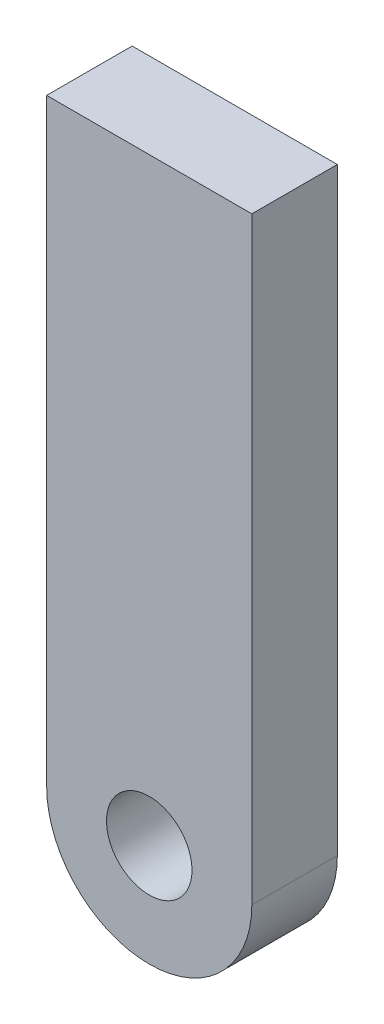
ISO-10303-21;
HEADER;
FILE_DESCRIPTION(('STEP AP214'),'2;1');
FILE_NAME('part.step','',(''),(''),'','','');
FILE_SCHEMA(('AUTOMOTIVE_DESIGN { 1 0 10303 214 1 1 1 1 }'));
ENDSEC;
DATA;
#1=APPLICATION_CONTEXT('core data for automotive mechanical design processes');
#2=APPLICATION_PROTOCOL_DEFINITION('international standard','automotive_design',2000,#1);
#3=PRODUCT_CONTEXT('',#1,'mechanical');
#4=PRODUCT('Part','Part','',(#3));
#5=PRODUCT_RELATED_PRODUCT_CATEGORY('part','',(#4));
#6=PRODUCT_DEFINITION_FORMATION('','',#4);
#7=PRODUCT_DEFINITION_CONTEXT('part definition',#1,'design');
#8=PRODUCT_DEFINITION('design','',#6,#7);
#9=PRODUCT_DEFINITION_SHAPE('','',#8);
#10=(LENGTH_UNIT() NAMED_UNIT(*) SI_UNIT(.MILLI.,.METRE.));
#11=(NAMED_UNIT(*) PLANE_ANGLE_UNIT() SI_UNIT($,.RADIAN.));
#12=(NAMED_UNIT(*) SI_UNIT($,.STERADIAN.) SOLID_ANGLE_UNIT());
#13=UNCERTAINTY_MEASURE_WITH_UNIT(LENGTH_MEASURE(1.E-05),#10,'distance_accuracy_value','');
#14=(GEOMETRIC_REPRESENTATION_CONTEXT(3) GLOBAL_UNCERTAINTY_ASSIGNED_CONTEXT((#13)) GLOBAL_UNIT_ASSIGNED_CONTEXT((#10,
#11,#12)) REPRESENTATION_CONTEXT('',''));
#15=CARTESIAN_POINT('',(0.,0.,0.));
#16=DIRECTION('',(0.,0.,1.));
#17=DIRECTION('',(1.,0.,0.));
#18=AXIS2_PLACEMENT_3D('',#15,#16,#17);
#19=CARTESIAN_POINT('',(0.,0.,6.35));
#20=DIRECTION('',(0.,0.,1.));
#21=DIRECTION('',(1.,0.,0.));
#22=AXIS2_PLACEMENT_3D('',#19,#20,#21);
#23=PLANE('',#22);
#24=CARTESIAN_POINT('',(0.,0.,6.35));
#25=DIRECTION('',(0.,0.,1.));
#26=DIRECTION('',(1.,0.,0.));
#27=AXIS2_PLACEMENT_3D('',#24,#25,#26);
#28=CIRCLE('',#27,7.62);
#29=CARTESIAN_POINT('',(-7.62,0.,6.35));
#30=VERTEX_POINT('',#29);
#31=CARTESIAN_POINT('',(7.62,0.,6.35));
#32=VERTEX_POINT('',#31);
#33=EDGE_CURVE('E85',#30,#32,#28,.T.);
#34=ORIENTED_EDGE('',*,*,#33,.T.);
#35=DIRECTION('',(0.,1.,0.));
#36=VECTOR('',#35,1.);
#37=CARTESIAN_POINT('',(7.62,0.,6.35));
#38=LINE('',#37,#36);
#39=CARTESIAN_POINT('',(7.61999999999999,44.45,6.35));
#40=VERTEX_POINT('',#39);
#41=EDGE_CURVE('E80',#32,#40,#38,.T.);
#42=ORIENTED_EDGE('',*,*,#41,.T.);
#43=DIRECTION('',(-1.,0.,0.));
#44=VECTOR('',#43,1.);
#45=CARTESIAN_POINT('',(-7.62,44.45,6.35));
#46=LINE('',#45,#44);
#47=CARTESIAN_POINT('',(-7.62,44.45,6.35));
#48=VERTEX_POINT('',#47);
#49=EDGE_CURVE('E83',#40,#48,#46,.T.);
#50=ORIENTED_EDGE('',*,*,#49,.T.);
#51=DIRECTION('',(0.,-1.,0.));
#52=VECTOR('',#51,1.);
#53=CARTESIAN_POINT('',(-7.62,0.,6.35));
#54=LINE('',#53,#52);
#55=EDGE_CURVE('E50',#48,#30,#54,.T.);
#56=ORIENTED_EDGE('',*,*,#55,.T.);
#57=EDGE_LOOP('',(#34,#42,#50,#56));
#58=FACE_BOUND('',#57,.T.);
#59=CARTESIAN_POINT('',(0.,0.,6.35));
#60=DIRECTION('',(0.,0.,1.));
#61=DIRECTION('',(1.,0.,0.));
#62=AXIS2_PLACEMENT_3D('',#59,#60,#61);
#63=CIRCLE('',#62,3.175);
#64=CARTESIAN_POINT('',(3.175,0.,6.35));
#65=VERTEX_POINT('',#64);
#66=EDGE_CURVE('E100',#65,#65,#63,.T.);
#67=ORIENTED_EDGE('',*,*,#66,.F.);
#68=EDGE_LOOP('',(#67));
#69=FACE_BOUND('',#68,.T.);
#70=ADVANCED_FACE('F33',(#58,#69),#23,.T.);
#71=CARTESIAN_POINT('',(0.,0.,0.));
#72=DIRECTION('',(0.,0.,1.));
#73=DIRECTION('',(1.,0.,0.));
#74=AXIS2_PLACEMENT_3D('',#71,#72,#73);
#75=PLANE('',#74);
#76=CARTESIAN_POINT('',(0.,0.,0.));
#77=DIRECTION('',(0.,0.,1.));
#78=DIRECTION('',(1.,0.,0.));
#79=AXIS2_PLACEMENT_3D('',#76,#77,#78);
#80=CIRCLE('',#79,7.62);
#81=CARTESIAN_POINT('',(-7.62,0.,0.));
#82=VERTEX_POINT('',#81);
#83=CARTESIAN_POINT('',(7.62,0.,0.));
#84=VERTEX_POINT('',#83);
#85=EDGE_CURVE('E97',#82,#84,#80,.T.);
#86=ORIENTED_EDGE('',*,*,#85,.F.);
#87=DIRECTION('',(0.,-1.,0.));
#88=VECTOR('',#87,1.);
#89=CARTESIAN_POINT('',(-7.62,0.,0.));
#90=LINE('',#89,#88);
#91=CARTESIAN_POINT('',(-7.62,44.45,0.));
#92=VERTEX_POINT('',#91);
#93=EDGE_CURVE('E73',#92,#82,#90,.T.);
#94=ORIENTED_EDGE('',*,*,#93,.F.);
#95=DIRECTION('',(-1.,0.,0.));
#96=VECTOR('',#95,1.);
#97=CARTESIAN_POINT('',(-7.62,44.45,0.));
#98=LINE('',#97,#96);
#99=CARTESIAN_POINT('',(7.61999999999999,44.45,0.));
#100=VERTEX_POINT('',#99);
#101=EDGE_CURVE('E67',#100,#92,#98,.T.);
#102=ORIENTED_EDGE('',*,*,#101,.F.);
#103=DIRECTION('',(0.,1.,0.));
#104=VECTOR('',#103,1.);
#105=CARTESIAN_POINT('',(7.62,0.,0.));
#106=LINE('',#105,#104);
#107=EDGE_CURVE('E89',#84,#100,#106,.T.);
#108=ORIENTED_EDGE('',*,*,#107,.F.);
#109=EDGE_LOOP('',(#86,#94,#102,#108));
#110=FACE_BOUND('',#109,.T.);
#111=CARTESIAN_POINT('',(0.,0.,0.));
#112=DIRECTION('',(0.,0.,1.));
#113=DIRECTION('',(1.,0.,0.));
#114=AXIS2_PLACEMENT_3D('',#111,#112,#113);
#115=CIRCLE('',#114,3.175);
#116=CARTESIAN_POINT('',(3.175,0.,0.));
#117=VERTEX_POINT('',#116);
#118=EDGE_CURVE('E112',#117,#117,#115,.T.);
#119=ORIENTED_EDGE('',*,*,#118,.T.);
#120=EDGE_LOOP('',(#119));
#121=FACE_BOUND('',#120,.T.);
#122=ADVANCED_FACE('F108',(#110,#121),#75,.F.);
#123=CARTESIAN_POINT('',(0.,0.,6.35));
#124=DIRECTION('',(0.,0.,-1.));
#125=DIRECTION('',(-1.,0.,0.));
#126=AXIS2_PLACEMENT_3D('',#123,#124,#125);
#127=CYLINDRICAL_SURFACE('',#126,7.62);
#128=ORIENTED_EDGE('',*,*,#85,.T.);
#129=DIRECTION('',(0.,0.,-1.));
#130=VECTOR('',#129,1.);
#131=CARTESIAN_POINT('',(7.62,0.,6.35));
#132=LINE('',#131,#130);
#133=EDGE_CURVE('E11',#32,#84,#132,.T.);
#134=ORIENTED_EDGE('',*,*,#133,.F.);
#135=ORIENTED_EDGE('',*,*,#33,.F.);
#136=DIRECTION('',(0.,0.,-1.));
#137=VECTOR('',#136,1.);
#138=CARTESIAN_POINT('',(-7.62,0.,6.35));
#139=LINE('',#138,#137);
#140=EDGE_CURVE('E93',#30,#82,#139,.T.);
#141=ORIENTED_EDGE('',*,*,#140,.T.);
#142=EDGE_LOOP('',(#128,#134,#135,#141));
#143=FACE_BOUND('',#142,.T.);
#144=ADVANCED_FACE('F35',(#143),#127,.T.);
#145=CARTESIAN_POINT('',(7.62,0.,6.35));
#146=DIRECTION('',(-1.,0.,0.));
#147=DIRECTION('',(0.,-1.,0.));
#148=AXIS2_PLACEMENT_3D('',#145,#146,#147);
#149=PLANE('',#148);
#150=ORIENTED_EDGE('',*,*,#107,.T.);
#151=DIRECTION('',(0.,0.,-1.));
#152=VECTOR('',#151,1.);
#153=CARTESIAN_POINT('',(7.61999999999999,44.45,6.35));
#154=LINE('',#153,#152);
#155=EDGE_CURVE('E42',#40,#100,#154,.T.);
#156=ORIENTED_EDGE('',*,*,#155,.F.);
#157=ORIENTED_EDGE('',*,*,#41,.F.);
#158=ORIENTED_EDGE('',*,*,#133,.T.);
#159=EDGE_LOOP('',(#150,#156,#157,#158));
#160=FACE_BOUND('',#159,.T.);
#161=ADVANCED_FACE('F88',(#160),#149,.F.);
#162=CARTESIAN_POINT('',(-7.62,44.45,6.35));
#163=DIRECTION('',(0.,-1.,0.));
#164=DIRECTION('',(0.,0.,-1.));
#165=AXIS2_PLACEMENT_3D('',#162,#163,#164);
#166=PLANE('',#165);
#167=ORIENTED_EDGE('',*,*,#101,.T.);
#168=DIRECTION('',(0.,0.,-1.));
#169=VECTOR('',#168,1.);
#170=CARTESIAN_POINT('',(-7.62,44.45,6.35));
#171=LINE('',#170,#169);
#172=EDGE_CURVE('E90',#48,#92,#171,.T.);
#173=ORIENTED_EDGE('',*,*,#172,.F.);
#174=ORIENTED_EDGE('',*,*,#49,.F.);
#175=ORIENTED_EDGE('',*,*,#155,.T.);
#176=EDGE_LOOP('',(#167,#173,#174,#175));
#177=FACE_BOUND('',#176,.T.);
#178=ADVANCED_FACE('F91',(#177),#166,.F.);
#179=CARTESIAN_POINT('',(-7.62,0.,6.35));
#180=DIRECTION('',(1.,0.,0.));
#181=DIRECTION('',(0.,0.,-1.));
#182=AXIS2_PLACEMENT_3D('',#179,#180,#181);
#183=PLANE('',#182);
#184=ORIENTED_EDGE('',*,*,#93,.T.);
#185=ORIENTED_EDGE('',*,*,#140,.F.);
#186=ORIENTED_EDGE('',*,*,#55,.F.);
#187=ORIENTED_EDGE('',*,*,#172,.T.);
#188=EDGE_LOOP('',(#184,#185,#186,#187));
#189=FACE_BOUND('',#188,.T.);
#190=ADVANCED_FACE('F105',(#189),#183,.F.);
#191=CARTESIAN_POINT('',(0.,0.,6.35));
#192=DIRECTION('',(0.,0.,-1.));
#193=DIRECTION('',(-1.,0.,0.));
#194=AXIS2_PLACEMENT_3D('',#191,#192,#193);
#195=CYLINDRICAL_SURFACE('',#194,3.175);
#196=ORIENTED_EDGE('',*,*,#66,.T.);
#197=EDGE_LOOP('',(#196));
#198=FACE_BOUND('',#197,.T.);
#199=ORIENTED_EDGE('',*,*,#118,.F.);
#200=EDGE_LOOP('',(#199));
#201=FACE_BOUND('',#200,.T.);
#202=ADVANCED_FACE('F118',(#198,#201),#195,.F.);
#203=CLOSED_SHELL('',(#70,#122,#144,#161,#178,#190,#202));
#204=MANIFOLD_SOLID_BREP('B2',#203);
#205=ADVANCED_BREP_SHAPE_REPRESENTATION('',(#18,#204),#14);
#206=SHAPE_DEFINITION_REPRESENTATION(#9,#205);
ENDSEC;
END-ISO-10303-21;
